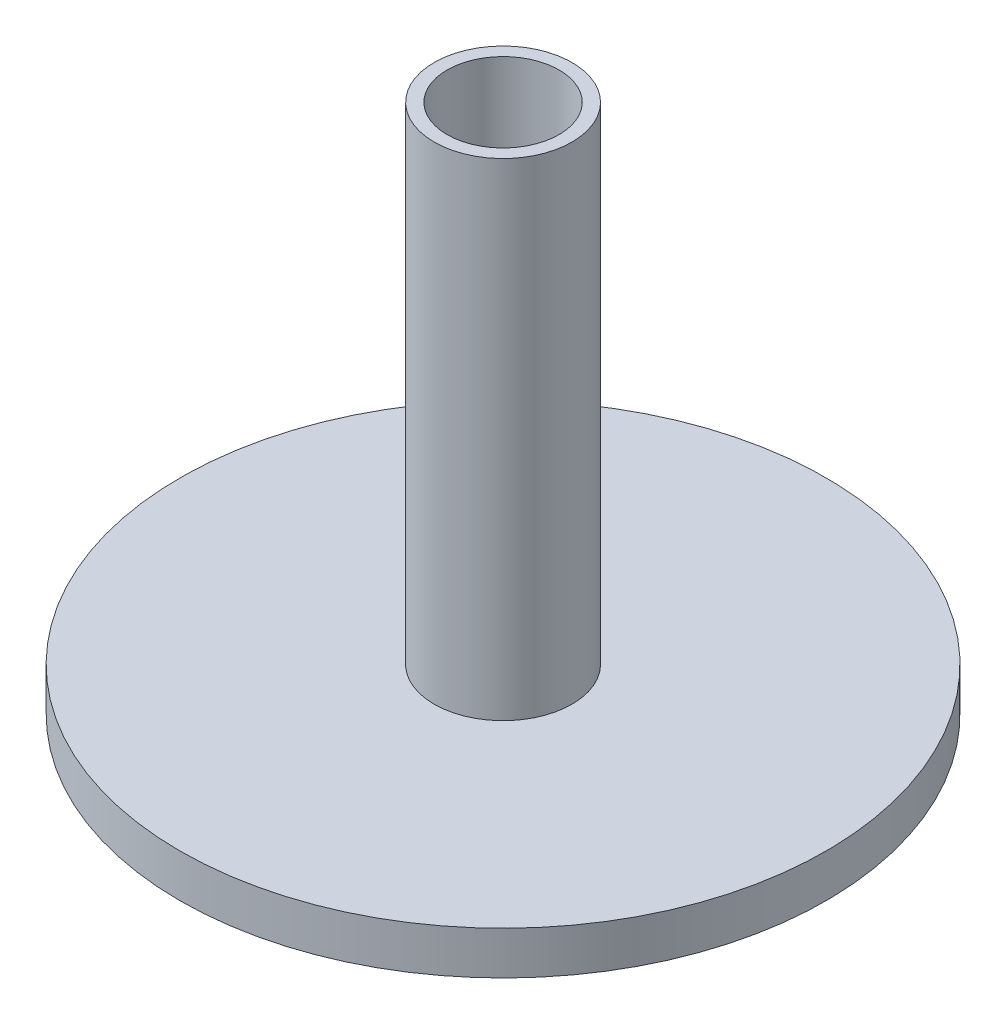
ISO-10303-21;
HEADER;
FILE_DESCRIPTION(('STEP AP214'),'2;1');
FILE_NAME('part.step','',(''),(''),'','','');
FILE_SCHEMA(('AUTOMOTIVE_DESIGN { 1 0 10303 214 1 1 1 1 }'));
ENDSEC;
DATA;
#1=APPLICATION_CONTEXT('core data for automotive mechanical design processes');
#2=APPLICATION_PROTOCOL_DEFINITION('international standard','automotive_design',2000,#1);
#3=PRODUCT_CONTEXT('',#1,'mechanical');
#4=PRODUCT('Part','Part','',(#3));
#5=PRODUCT_RELATED_PRODUCT_CATEGORY('part','',(#4));
#6=PRODUCT_DEFINITION_FORMATION('','',#4);
#7=PRODUCT_DEFINITION_CONTEXT('part definition',#1,'design');
#8=PRODUCT_DEFINITION('design','',#6,#7);
#9=PRODUCT_DEFINITION_SHAPE('','',#8);
#10=(LENGTH_UNIT() NAMED_UNIT(*) SI_UNIT(.MILLI.,.METRE.));
#11=(NAMED_UNIT(*) PLANE_ANGLE_UNIT() SI_UNIT($,.RADIAN.));
#12=(NAMED_UNIT(*) SI_UNIT($,.STERADIAN.) SOLID_ANGLE_UNIT());
#13=UNCERTAINTY_MEASURE_WITH_UNIT(LENGTH_MEASURE(1.E-05),#10,'distance_accuracy_value','');
#14=(GEOMETRIC_REPRESENTATION_CONTEXT(3) GLOBAL_UNCERTAINTY_ASSIGNED_CONTEXT((#13)) GLOBAL_UNIT_ASSIGNED_CONTEXT((#10,
#11,#12)) REPRESENTATION_CONTEXT('',''));
#15=CARTESIAN_POINT('',(0.,0.,0.));
#16=DIRECTION('',(0.,0.,1.));
#17=DIRECTION('',(1.,0.,0.));
#18=AXIS2_PLACEMENT_3D('',#15,#16,#17);
#19=CARTESIAN_POINT('',(0.,10.,0.));
#20=DIRECTION('',(0.,-1.,0.));
#21=DIRECTION('',(0.,0.,-1.));
#22=AXIS2_PLACEMENT_3D('',#19,#20,#21);
#23=CYLINDRICAL_SURFACE('',#22,75.);
#24=CARTESIAN_POINT('',(0.,10.,0.));
#25=DIRECTION('',(0.,1.,0.));
#26=DIRECTION('',(0.,0.,1.));
#27=AXIS2_PLACEMENT_3D('',#24,#25,#26);
#28=CIRCLE('',#27,75.);
#29=CARTESIAN_POINT('',(0.,10.,75.));
#30=VERTEX_POINT('',#29);
#31=EDGE_CURVE('E44',#30,#30,#28,.T.);
#32=ORIENTED_EDGE('',*,*,#31,.F.);
#33=EDGE_LOOP('',(#32));
#34=FACE_BOUND('',#33,.T.);
#35=CARTESIAN_POINT('',(0.,0.,0.));
#36=DIRECTION('',(0.,1.,0.));
#37=DIRECTION('',(0.,0.,1.));
#38=AXIS2_PLACEMENT_3D('',#35,#36,#37);
#39=CIRCLE('',#38,75.);
#40=CARTESIAN_POINT('',(0.,0.,75.));
#41=VERTEX_POINT('',#40);
#42=EDGE_CURVE('E49',#41,#41,#39,.T.);
#43=ORIENTED_EDGE('',*,*,#42,.T.);
#44=EDGE_LOOP('',(#43));
#45=FACE_BOUND('',#44,.T.);
#46=ADVANCED_FACE('F37',(#34,#45),#23,.T.);
#47=CARTESIAN_POINT('',(0.,10.,0.));
#48=DIRECTION('',(0.,1.,0.));
#49=DIRECTION('',(0.,0.,1.));
#50=AXIS2_PLACEMENT_3D('',#47,#48,#49);
#51=PLANE('',#50);
#52=CARTESIAN_POINT('',(0.,10.,0.));
#53=DIRECTION('',(0.,1.,0.));
#54=DIRECTION('',(0.,0.,1.));
#55=AXIS2_PLACEMENT_3D('',#52,#53,#54);
#56=CIRCLE('',#55,16.);
#57=CARTESIAN_POINT('',(0.,10.,16.));
#58=VERTEX_POINT('',#57);
#59=EDGE_CURVE('E57',#58,#58,#56,.T.);
#60=ORIENTED_EDGE('',*,*,#59,.F.);
#61=EDGE_LOOP('',(#60));
#62=FACE_BOUND('',#61,.T.);
#63=ORIENTED_EDGE('',*,*,#31,.T.);
#64=EDGE_LOOP('',(#63));
#65=FACE_BOUND('',#64,.T.);
#66=ADVANCED_FACE('F83',(#62,#65),#51,.T.);
#67=CARTESIAN_POINT('',(0.,0.,0.));
#68=DIRECTION('',(0.,1.,0.));
#69=DIRECTION('',(0.,0.,1.));
#70=AXIS2_PLACEMENT_3D('',#67,#68,#69);
#71=PLANE('',#70);
#72=ORIENTED_EDGE('',*,*,#42,.F.);
#73=EDGE_LOOP('',(#72));
#74=FACE_BOUND('',#73,.T.);
#75=ADVANCED_FACE('F74',(#74),#71,.F.);
#76=CARTESIAN_POINT('',(0.,123.,0.));
#77=DIRECTION('',(0.,1.,0.));
#78=DIRECTION('',(0.,0.,1.));
#79=AXIS2_PLACEMENT_3D('',#76,#77,#78);
#80=PLANE('',#79);
#81=CARTESIAN_POINT('',(0.,123.,0.));
#82=DIRECTION('',(0.,1.,0.));
#83=DIRECTION('',(0.,0.,1.));
#84=AXIS2_PLACEMENT_3D('',#81,#82,#83);
#85=CIRCLE('',#84,16.);
#86=CARTESIAN_POINT('',(0.,123.,16.));
#87=VERTEX_POINT('',#86);
#88=EDGE_CURVE('E55',#87,#87,#85,.T.);
#89=ORIENTED_EDGE('',*,*,#88,.T.);
#90=EDGE_LOOP('',(#89));
#91=FACE_BOUND('',#90,.T.);
#92=CARTESIAN_POINT('',(0.,123.,0.));
#93=DIRECTION('',(0.,1.,0.));
#94=DIRECTION('',(0.,0.,1.));
#95=AXIS2_PLACEMENT_3D('',#92,#93,#94);
#96=CIRCLE('',#95,13.);
#97=CARTESIAN_POINT('',(0.,123.,13.));
#98=VERTEX_POINT('',#97);
#99=EDGE_CURVE('E61',#98,#98,#96,.T.);
#100=ORIENTED_EDGE('',*,*,#99,.F.);
#101=EDGE_LOOP('',(#100));
#102=FACE_BOUND('',#101,.T.);
#103=ADVANCED_FACE('F71',(#91,#102),#80,.T.);
#104=CARTESIAN_POINT('',(0.,123.,0.));
#105=DIRECTION('',(0.,-1.,0.));
#106=DIRECTION('',(0.,0.,-1.));
#107=AXIS2_PLACEMENT_3D('',#104,#105,#106);
#108=CYLINDRICAL_SURFACE('',#107,16.);
#109=ORIENTED_EDGE('',*,*,#88,.F.);
#110=EDGE_LOOP('',(#109));
#111=FACE_BOUND('',#110,.T.);
#112=ORIENTED_EDGE('',*,*,#59,.T.);
#113=EDGE_LOOP('',(#112));
#114=FACE_BOUND('',#113,.T.);
#115=ADVANCED_FACE('F73',(#111,#114),#108,.T.);
#116=CARTESIAN_POINT('',(0.,123.,0.));
#117=DIRECTION('',(0.,-1.,0.));
#118=DIRECTION('',(0.,0.,-1.));
#119=AXIS2_PLACEMENT_3D('',#116,#117,#118);
#120=CYLINDRICAL_SURFACE('',#119,13.);
#121=ORIENTED_EDGE('',*,*,#99,.T.);
#122=EDGE_LOOP('',(#121));
#123=FACE_BOUND('',#122,.T.);
#124=CARTESIAN_POINT('',(0.,9.99999999999999,0.));
#125=DIRECTION('',(0.,1.,0.));
#126=DIRECTION('',(0.,0.,1.));
#127=AXIS2_PLACEMENT_3D('',#124,#125,#126);
#128=CIRCLE('',#127,13.);
#129=CARTESIAN_POINT('',(0.,9.99999999999999,13.));
#130=VERTEX_POINT('',#129);
#131=EDGE_CURVE('E10',#130,#130,#128,.F.);
#132=ORIENTED_EDGE('',*,*,#131,.T.);
#133=EDGE_LOOP('',(#132));
#134=FACE_BOUND('',#133,.T.);
#135=ADVANCED_FACE('F69',(#123,#134),#120,.F.);
#136=ORIENTED_EDGE('',*,*,#131,.F.);
#137=EDGE_LOOP('',(#136));
#138=FACE_BOUND('',#137,.T.);
#139=ADVANCED_FACE('F93',(#138),#51,.T.);
#140=CLOSED_SHELL('',(#46,#66,#75,#103,#115,#135,#139));
#141=MANIFOLD_SOLID_BREP('B2',#140);
#142=ADVANCED_BREP_SHAPE_REPRESENTATION('',(#18,#141),#14);
#143=SHAPE_DEFINITION_REPRESENTATION(#9,#142);
ENDSEC;
END-ISO-10303-21;
